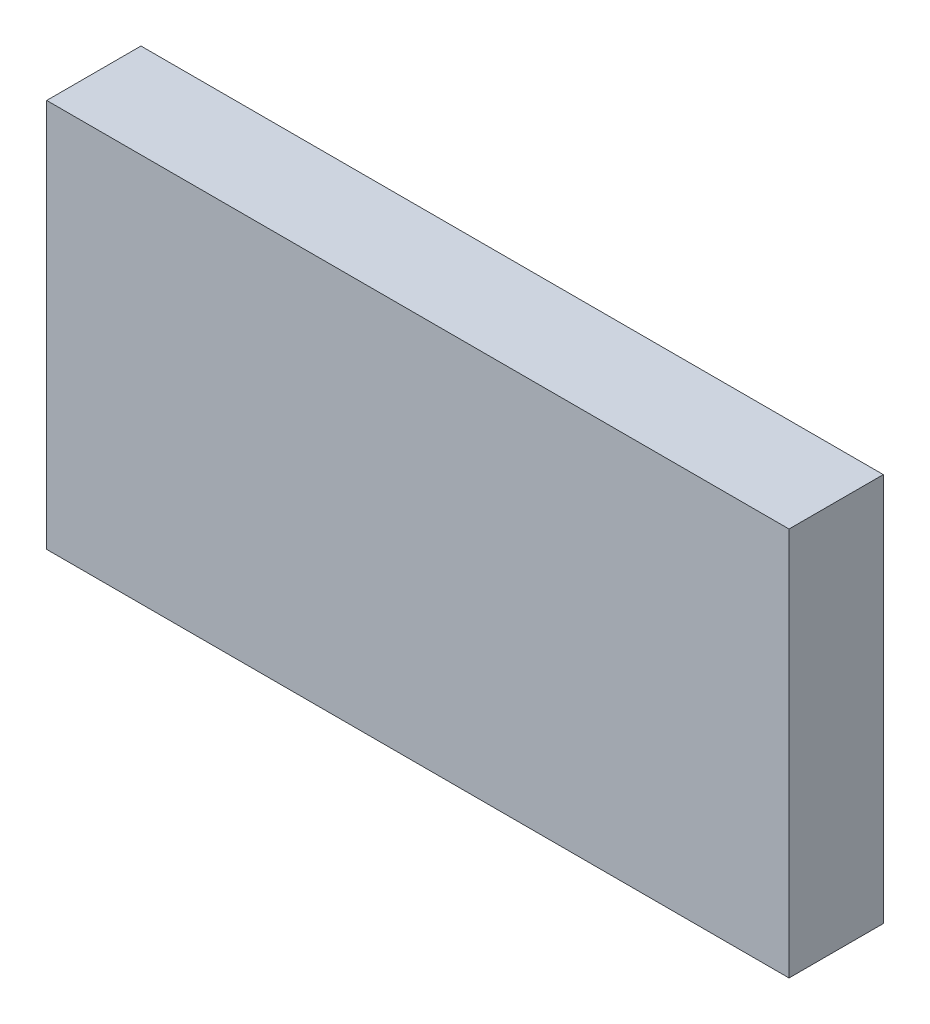
ISO-10303-21;
HEADER;
FILE_DESCRIPTION(('STEP AP214'),'2;1');
FILE_NAME('part.step','',(''),(''),'','','');
FILE_SCHEMA(('AUTOMOTIVE_DESIGN { 1 0 10303 214 1 1 1 1 }'));
ENDSEC;
DATA;
#1=APPLICATION_CONTEXT('core data for automotive mechanical design processes');
#2=APPLICATION_PROTOCOL_DEFINITION('international standard','automotive_design',2000,#1);
#3=PRODUCT_CONTEXT('',#1,'mechanical');
#4=PRODUCT('Part','Part','',(#3));
#5=PRODUCT_RELATED_PRODUCT_CATEGORY('part','',(#4));
#6=PRODUCT_DEFINITION_FORMATION('','',#4);
#7=PRODUCT_DEFINITION_CONTEXT('part definition',#1,'design');
#8=PRODUCT_DEFINITION('design','',#6,#7);
#9=PRODUCT_DEFINITION_SHAPE('','',#8);
#10=(LENGTH_UNIT() NAMED_UNIT(*) SI_UNIT(.MILLI.,.METRE.));
#11=(NAMED_UNIT(*) PLANE_ANGLE_UNIT() SI_UNIT($,.RADIAN.));
#12=(NAMED_UNIT(*) SI_UNIT($,.STERADIAN.) SOLID_ANGLE_UNIT());
#13=UNCERTAINTY_MEASURE_WITH_UNIT(LENGTH_MEASURE(1.E-05),#10,'distance_accuracy_value','');
#14=(GEOMETRIC_REPRESENTATION_CONTEXT(3) GLOBAL_UNCERTAINTY_ASSIGNED_CONTEXT((#13)) GLOBAL_UNIT_ASSIGNED_CONTEXT((#10,
#11,#12)) REPRESENTATION_CONTEXT('',''));
#15=CARTESIAN_POINT('',(0.,0.,0.));
#16=DIRECTION('',(0.,0.,1.));
#17=DIRECTION('',(1.,0.,0.));
#18=AXIS2_PLACEMENT_3D('',#15,#16,#17);
#19=CARTESIAN_POINT('',(28.8721990846372,-15.619026203913,1.03674101378445E-06));
#20=DIRECTION('',(0.,8.74227339409092E-08,-1.));
#21=DIRECTION('',(-1.,8.74227765734792E-08,0.));
#22=AXIS2_PLACEMENT_3D('',#19,#20,#21);
#23=PLANE('',#22);
#24=DIRECTION('',(1.,-8.74227767111557E-08,0.));
#25=VECTOR('',#24,1.);
#26=CARTESIAN_POINT('',(28.8721989403897,-17.2690262039129,8.92493502713254E-07));
#27=LINE('',#26,#25);
#28=CARTESIAN_POINT('',(25.7221989403896,-17.2690259285312,8.92493526999383E-07));
#29=VERTEX_POINT('',#28);
#30=CARTESIAN_POINT('',(32.0221989403897,-17.2690264792947,8.92493478860806E-07));
#31=VERTEX_POINT('',#30);
#32=EDGE_CURVE('E90',#29,#31,#27,.T.);
#33=ORIENTED_EDGE('',*,*,#32,.T.);
#34=DIRECTION('',(8.74227765734795E-08,1.,8.74227339409088E-08));
#35=VECTOR('',#34,1.);
#36=CARTESIAN_POINT('',(32.0221990846372,-15.6190264792947,1.03674098949832E-06));
#37=LINE('',#36,#35);
#38=CARTESIAN_POINT('',(32.0221992288848,-13.9690264792947,1.18098850056952E-06));
#39=VERTEX_POINT('',#38);
#40=EDGE_CURVE('E27',#31,#39,#37,.T.);
#41=ORIENTED_EDGE('',*,*,#40,.T.);
#42=DIRECTION('',(1.,-8.74227767111557E-08,0.));
#43=VECTOR('',#42,1.);
#44=CARTESIAN_POINT('',(28.8721992288848,-13.969026203913,1.18098852485565E-06));
#45=LINE('',#44,#43);
#46=CARTESIAN_POINT('',(25.7221992288849,-13.9690259285312,1.1809885487081E-06));
#47=VERTEX_POINT('',#46);
#48=EDGE_CURVE('E78',#47,#39,#45,.T.);
#49=ORIENTED_EDGE('',*,*,#48,.F.);
#50=DIRECTION('',(8.74227765734795E-08,1.,8.74227339409088E-08));
#51=VECTOR('',#50,1.);
#52=CARTESIAN_POINT('',(25.7221990846372,-15.6190259285313,1.03674103807058E-06));
#53=LINE('',#52,#51);
#54=EDGE_CURVE('E101',#29,#47,#53,.T.);
#55=ORIENTED_EDGE('',*,*,#54,.F.);
#56=EDGE_LOOP('',(#33,#41,#49,#55));
#57=FACE_BOUND('',#56,.T.);
#58=ADVANCED_FACE('F17',(#57),#23,.F.);
#59=CARTESIAN_POINT('',(28.8721990846372,-15.6190261339748,-0.799998963258982));
#60=DIRECTION('',(0.,8.74227339409092E-08,-1.));
#61=DIRECTION('',(-1.,8.74227765734792E-08,0.));
#62=AXIS2_PLACEMENT_3D('',#59,#60,#61);
#63=PLANE('',#62);
#64=DIRECTION('',(1.,-8.74227767111557E-08,0.));
#65=VECTOR('',#64,1.);
#66=CARTESIAN_POINT('',(28.8721989403897,-17.2690261339748,-0.799999107506493));
#67=LINE('',#66,#65);
#68=CARTESIAN_POINT('',(25.7221989403896,-17.2690258585931,-0.799999107506469));
#69=VERTEX_POINT('',#68);
#70=CARTESIAN_POINT('',(32.0221989403897,-17.2690264093566,-0.799999107506517));
#71=VERTEX_POINT('',#70);
#72=EDGE_CURVE('E81',#69,#71,#67,.T.);
#73=ORIENTED_EDGE('',*,*,#72,.F.);
#74=DIRECTION('',(8.74227765734795E-08,1.,8.74227339409088E-08));
#75=VECTOR('',#74,1.);
#76=CARTESIAN_POINT('',(25.7221990846372,-15.6190258585931,-0.799998963258958));
#77=LINE('',#76,#75);
#78=CARTESIAN_POINT('',(25.7221992288849,-13.9690258585931,-0.799998819011447));
#79=VERTEX_POINT('',#78);
#80=EDGE_CURVE('E67',#69,#79,#77,.T.);
#81=ORIENTED_EDGE('',*,*,#80,.T.);
#82=DIRECTION('',(1.,-8.74227767111557E-08,0.));
#83=VECTOR('',#82,1.);
#84=CARTESIAN_POINT('',(28.8721992288848,-13.9690261339748,-0.799998819011471));
#85=LINE('',#84,#83);
#86=CARTESIAN_POINT('',(32.0221992288848,-13.9690264093565,-0.799998819011495));
#87=VERTEX_POINT('',#86);
#88=EDGE_CURVE('E111',#79,#87,#85,.T.);
#89=ORIENTED_EDGE('',*,*,#88,.T.);
#90=DIRECTION('',(8.74227765734795E-08,1.,8.74227339409088E-08));
#91=VECTOR('',#90,1.);
#92=CARTESIAN_POINT('',(32.0221990846372,-15.6190264093566,-0.799998963259006));
#93=LINE('',#92,#91);
#94=EDGE_CURVE('E11',#71,#87,#93,.T.);
#95=ORIENTED_EDGE('',*,*,#94,.F.);
#96=EDGE_LOOP('',(#73,#81,#89,#95));
#97=FACE_BOUND('',#96,.T.);
#98=ADVANCED_FACE('F82',(#97),#63,.T.);
#99=CARTESIAN_POINT('',(32.0221990846372,-15.6190264093566,-0.799998963259006));
#100=DIRECTION('',(1.,-8.74227765734792E-08,0.));
#101=DIRECTION('',(0.,8.74227339409092E-08,-1.));
#102=AXIS2_PLACEMENT_3D('',#99,#100,#101);
#103=PLANE('',#102);
#104=ORIENTED_EDGE('',*,*,#40,.F.);
#105=DIRECTION('',(0.,-8.74227339409092E-08,1.));
#106=VECTOR('',#105,1.);
#107=CARTESIAN_POINT('',(32.0221989403897,-17.2690264093566,-0.799999107506517));
#108=LINE('',#107,#106);
#109=EDGE_CURVE('E86',#71,#31,#108,.T.);
#110=ORIENTED_EDGE('',*,*,#109,.F.);
#111=ORIENTED_EDGE('',*,*,#94,.T.);
#112=DIRECTION('',(0.,-8.74227339409092E-08,1.));
#113=VECTOR('',#112,1.);
#114=CARTESIAN_POINT('',(32.0221992288848,-13.9690264093565,-0.799998819011495));
#115=LINE('',#114,#113);
#116=EDGE_CURVE('E108',#87,#39,#115,.T.);
#117=ORIENTED_EDGE('',*,*,#116,.T.);
#118=EDGE_LOOP('',(#104,#110,#111,#117));
#119=FACE_BOUND('',#118,.T.);
#120=ADVANCED_FACE('F140',(#119),#103,.T.);
#121=CARTESIAN_POINT('',(28.8721992288848,-13.9690261339748,-0.799998819011471));
#122=DIRECTION('',(-8.7422776711156E-08,-1.,-8.74227339409088E-08));
#123=DIRECTION('',(-1.,8.74227767111557E-08,0.));
#124=AXIS2_PLACEMENT_3D('',#121,#122,#123);
#125=PLANE('',#124);
#126=ORIENTED_EDGE('',*,*,#48,.T.);
#127=ORIENTED_EDGE('',*,*,#116,.F.);
#128=ORIENTED_EDGE('',*,*,#88,.F.);
#129=DIRECTION('',(0.,-8.74227339409092E-08,1.));
#130=VECTOR('',#129,1.);
#131=CARTESIAN_POINT('',(25.7221992288849,-13.9690258585931,-0.799998819011447));
#132=LINE('',#131,#130);
#133=EDGE_CURVE('E75',#79,#47,#132,.T.);
#134=ORIENTED_EDGE('',*,*,#133,.T.);
#135=EDGE_LOOP('',(#126,#127,#128,#134));
#136=FACE_BOUND('',#135,.T.);
#137=ADVANCED_FACE('F139',(#136),#125,.F.);
#138=CARTESIAN_POINT('',(25.7221990846372,-15.6190258585931,-0.799998963258958));
#139=DIRECTION('',(1.,-8.74227765734792E-08,0.));
#140=DIRECTION('',(0.,8.74227339409092E-08,-1.));
#141=AXIS2_PLACEMENT_3D('',#138,#139,#140);
#142=PLANE('',#141);
#143=ORIENTED_EDGE('',*,*,#54,.T.);
#144=ORIENTED_EDGE('',*,*,#133,.F.);
#145=ORIENTED_EDGE('',*,*,#80,.F.);
#146=DIRECTION('',(0.,-8.74227339409092E-08,1.));
#147=VECTOR('',#146,1.);
#148=CARTESIAN_POINT('',(25.7221989403896,-17.2690258585931,-0.799999107506469));
#149=LINE('',#148,#147);
#150=EDGE_CURVE('E72',#69,#29,#149,.T.);
#151=ORIENTED_EDGE('',*,*,#150,.T.);
#152=EDGE_LOOP('',(#143,#144,#145,#151));
#153=FACE_BOUND('',#152,.T.);
#154=ADVANCED_FACE('F70',(#153),#142,.F.);
#155=CARTESIAN_POINT('',(28.8721989403897,-17.2690261339748,-0.799999107506493));
#156=DIRECTION('',(-8.7422776711156E-08,-1.,-8.74227339409088E-08));
#157=DIRECTION('',(-1.,8.74227767111557E-08,0.));
#158=AXIS2_PLACEMENT_3D('',#155,#156,#157);
#159=PLANE('',#158);
#160=ORIENTED_EDGE('',*,*,#32,.F.);
#161=ORIENTED_EDGE('',*,*,#150,.F.);
#162=ORIENTED_EDGE('',*,*,#72,.T.);
#163=ORIENTED_EDGE('',*,*,#109,.T.);
#164=EDGE_LOOP('',(#160,#161,#162,#163));
#165=FACE_BOUND('',#164,.T.);
#166=ADVANCED_FACE('F88',(#165),#159,.T.);
#167=CLOSED_SHELL('',(#58,#98,#120,#137,#154,#166));
#168=MANIFOLD_SOLID_BREP('B1',#167);
#169=ADVANCED_BREP_SHAPE_REPRESENTATION('',(#18,#168),#14);
#170=SHAPE_DEFINITION_REPRESENTATION(#9,#169);
ENDSEC;
END-ISO-10303-21;
